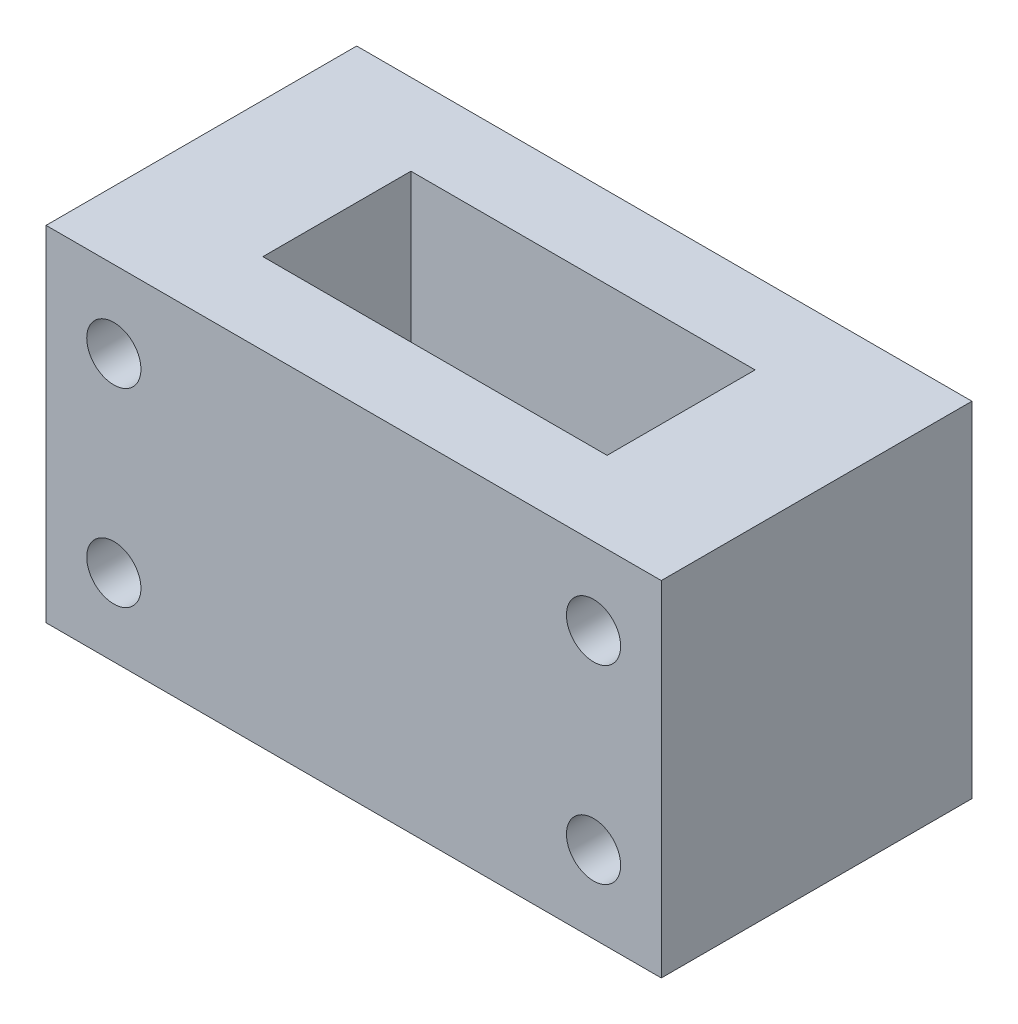
ISO-10303-21;
HEADER;
FILE_DESCRIPTION(('STEP AP214'),'2;1');
FILE_NAME('part.step','',(''),(''),'','','');
FILE_SCHEMA(('AUTOMOTIVE_DESIGN { 1 0 10303 214 1 1 1 1 }'));
ENDSEC;
DATA;
#1=APPLICATION_CONTEXT('core data for automotive mechanical design processes');
#2=APPLICATION_PROTOCOL_DEFINITION('international standard','automotive_design',2000,#1);
#3=PRODUCT_CONTEXT('',#1,'mechanical');
#4=PRODUCT('Part','Part','',(#3));
#5=PRODUCT_RELATED_PRODUCT_CATEGORY('part','',(#4));
#6=PRODUCT_DEFINITION_FORMATION('','',#4);
#7=PRODUCT_DEFINITION_CONTEXT('part definition',#1,'design');
#8=PRODUCT_DEFINITION('design','',#6,#7);
#9=PRODUCT_DEFINITION_SHAPE('','',#8);
#10=(LENGTH_UNIT() NAMED_UNIT(*) SI_UNIT(.MILLI.,.METRE.));
#11=(NAMED_UNIT(*) PLANE_ANGLE_UNIT() SI_UNIT($,.RADIAN.));
#12=(NAMED_UNIT(*) SI_UNIT($,.STERADIAN.) SOLID_ANGLE_UNIT());
#13=UNCERTAINTY_MEASURE_WITH_UNIT(LENGTH_MEASURE(1.E-05),#10,'distance_accuracy_value','');
#14=(GEOMETRIC_REPRESENTATION_CONTEXT(3) GLOBAL_UNCERTAINTY_ASSIGNED_CONTEXT((#13)) GLOBAL_UNIT_ASSIGNED_CONTEXT((#10,
#11,#12)) REPRESENTATION_CONTEXT('',''));
#15=CARTESIAN_POINT('',(0.,0.,0.));
#16=DIRECTION('',(0.,0.,1.));
#17=DIRECTION('',(1.,0.,0.));
#18=AXIS2_PLACEMENT_3D('',#15,#16,#17);
#19=CARTESIAN_POINT('',(0.,25.4,0.));
#20=DIRECTION('',(0.,1.,0.));
#21=DIRECTION('',(0.,0.,1.));
#22=AXIS2_PLACEMENT_3D('',#19,#20,#21);
#23=PLANE('',#22);
#24=DIRECTION('',(0.,0.,-1.));
#25=VECTOR('',#24,1.);
#26=CARTESIAN_POINT('',(22.7,25.4,-11.461));
#27=LINE('',#26,#25);
#28=CARTESIAN_POINT('',(22.7,25.4,11.461));
#29=VERTEX_POINT('',#28);
#30=CARTESIAN_POINT('',(22.7,25.4,-11.461));
#31=VERTEX_POINT('',#30);
#32=EDGE_CURVE('E140',#29,#31,#27,.T.);
#33=ORIENTED_EDGE('',*,*,#32,.T.);
#34=DIRECTION('',(-1.,0.,0.));
#35=VECTOR('',#34,1.);
#36=CARTESIAN_POINT('',(-22.7,25.4,-11.461));
#37=LINE('',#36,#35);
#38=CARTESIAN_POINT('',(-22.7,25.4,-11.461));
#39=VERTEX_POINT('',#38);
#40=EDGE_CURVE('E143',#31,#39,#37,.T.);
#41=ORIENTED_EDGE('',*,*,#40,.T.);
#42=DIRECTION('',(0.,0.,1.));
#43=VECTOR('',#42,1.);
#44=CARTESIAN_POINT('',(-22.7,25.4,-11.461));
#45=LINE('',#44,#43);
#46=CARTESIAN_POINT('',(-22.7,25.4,11.461));
#47=VERTEX_POINT('',#46);
#48=EDGE_CURVE('E146',#39,#47,#45,.T.);
#49=ORIENTED_EDGE('',*,*,#48,.T.);
#50=DIRECTION('',(1.,0.,0.));
#51=VECTOR('',#50,1.);
#52=CARTESIAN_POINT('',(-22.7,25.4,11.461));
#53=LINE('',#52,#51);
#54=EDGE_CURVE('E148',#47,#29,#53,.T.);
#55=ORIENTED_EDGE('',*,*,#54,.T.);
#56=EDGE_LOOP('',(#33,#41,#49,#55));
#57=FACE_BOUND('',#56,.T.);
#58=DIRECTION('',(-1.,0.,0.));
#59=VECTOR('',#58,1.);
#60=CARTESIAN_POINT('',(-12.7,25.4,-5.461));
#61=LINE('',#60,#59);
#62=CARTESIAN_POINT('',(12.7,25.4,-5.461));
#63=VERTEX_POINT('',#62);
#64=CARTESIAN_POINT('',(-12.7,25.4,-5.461));
#65=VERTEX_POINT('',#64);
#66=EDGE_CURVE('E110',#63,#65,#61,.T.);
#67=ORIENTED_EDGE('',*,*,#66,.F.);
#68=DIRECTION('',(0.,0.,-1.));
#69=VECTOR('',#68,1.);
#70=CARTESIAN_POINT('',(12.7,25.4,5.461));
#71=LINE('',#70,#69);
#72=CARTESIAN_POINT('',(12.7,25.4,5.461));
#73=VERTEX_POINT('',#72);
#74=EDGE_CURVE('E102',#73,#63,#71,.T.);
#75=ORIENTED_EDGE('',*,*,#74,.F.);
#76=DIRECTION('',(1.,0.,0.));
#77=VECTOR('',#76,1.);
#78=CARTESIAN_POINT('',(-12.7,25.4,5.461));
#79=LINE('',#78,#77);
#80=CARTESIAN_POINT('',(-12.7,25.4,5.461));
#81=VERTEX_POINT('',#80);
#82=EDGE_CURVE('E124',#81,#73,#79,.T.);
#83=ORIENTED_EDGE('',*,*,#82,.F.);
#84=DIRECTION('',(0.,0.,1.));
#85=VECTOR('',#84,1.);
#86=CARTESIAN_POINT('',(-12.7,25.4,5.461));
#87=LINE('',#86,#85);
#88=EDGE_CURVE('E122',#65,#81,#87,.T.);
#89=ORIENTED_EDGE('',*,*,#88,.F.);
#90=EDGE_LOOP('',(#67,#75,#83,#89));
#91=FACE_BOUND('',#90,.T.);
#92=ADVANCED_FACE('F37',(#57,#91),#23,.T.);
#93=CARTESIAN_POINT('',(0.,0.,0.));
#94=DIRECTION('',(0.,1.,0.));
#95=DIRECTION('',(0.,0.,1.));
#96=AXIS2_PLACEMENT_3D('',#93,#94,#95);
#97=PLANE('',#96);
#98=DIRECTION('',(0.,0.,-1.));
#99=VECTOR('',#98,1.);
#100=CARTESIAN_POINT('',(22.7,0.,-11.461));
#101=LINE('',#100,#99);
#102=CARTESIAN_POINT('',(22.7,0.,11.461));
#103=VERTEX_POINT('',#102);
#104=CARTESIAN_POINT('',(22.7,0.,-11.461));
#105=VERTEX_POINT('',#104);
#106=EDGE_CURVE('E118',#103,#105,#101,.T.);
#107=ORIENTED_EDGE('',*,*,#106,.F.);
#108=DIRECTION('',(1.,0.,0.));
#109=VECTOR('',#108,1.);
#110=CARTESIAN_POINT('',(-22.7,0.,11.461));
#111=LINE('',#110,#109);
#112=CARTESIAN_POINT('',(-22.7,0.,11.461));
#113=VERTEX_POINT('',#112);
#114=EDGE_CURVE('E144',#113,#103,#111,.T.);
#115=ORIENTED_EDGE('',*,*,#114,.F.);
#116=DIRECTION('',(0.,0.,1.));
#117=VECTOR('',#116,1.);
#118=CARTESIAN_POINT('',(-22.7,0.,-11.461));
#119=LINE('',#118,#117);
#120=CARTESIAN_POINT('',(-22.7,0.,-11.461));
#121=VERTEX_POINT('',#120);
#122=EDGE_CURVE('E155',#121,#113,#119,.T.);
#123=ORIENTED_EDGE('',*,*,#122,.F.);
#124=DIRECTION('',(-1.,0.,0.));
#125=VECTOR('',#124,1.);
#126=CARTESIAN_POINT('',(-22.7,0.,-11.461));
#127=LINE('',#126,#125);
#128=EDGE_CURVE('E153',#105,#121,#127,.T.);
#129=ORIENTED_EDGE('',*,*,#128,.F.);
#130=EDGE_LOOP('',(#107,#115,#123,#129));
#131=FACE_BOUND('',#130,.T.);
#132=DIRECTION('',(0.,0.,-1.));
#133=VECTOR('',#132,1.);
#134=CARTESIAN_POINT('',(12.7,0.,5.461));
#135=LINE('',#134,#133);
#136=CARTESIAN_POINT('',(12.7,0.,5.461));
#137=VERTEX_POINT('',#136);
#138=CARTESIAN_POINT('',(12.7,0.,-5.461));
#139=VERTEX_POINT('',#138);
#140=EDGE_CURVE('E60',#137,#139,#135,.T.);
#141=ORIENTED_EDGE('',*,*,#140,.T.);
#142=DIRECTION('',(-1.,0.,0.));
#143=VECTOR('',#142,1.);
#144=CARTESIAN_POINT('',(-12.7,0.,-5.461));
#145=LINE('',#144,#143);
#146=CARTESIAN_POINT('',(-12.7,0.,-5.461));
#147=VERTEX_POINT('',#146);
#148=EDGE_CURVE('E117',#139,#147,#145,.T.);
#149=ORIENTED_EDGE('',*,*,#148,.T.);
#150=DIRECTION('',(0.,0.,1.));
#151=VECTOR('',#150,1.);
#152=CARTESIAN_POINT('',(-12.7,0.,5.461));
#153=LINE('',#152,#151);
#154=CARTESIAN_POINT('',(-12.7,0.,5.461));
#155=VERTEX_POINT('',#154);
#156=EDGE_CURVE('E132',#147,#155,#153,.T.);
#157=ORIENTED_EDGE('',*,*,#156,.T.);
#158=DIRECTION('',(1.,0.,0.));
#159=VECTOR('',#158,1.);
#160=CARTESIAN_POINT('',(-12.7,0.,5.461));
#161=LINE('',#160,#159);
#162=EDGE_CURVE('E111',#155,#137,#161,.T.);
#163=ORIENTED_EDGE('',*,*,#162,.T.);
#164=EDGE_LOOP('',(#141,#149,#157,#163));
#165=FACE_BOUND('',#164,.T.);
#166=ADVANCED_FACE('F173',(#131,#165),#97,.F.);
#167=CARTESIAN_POINT('',(22.7,25.4,-11.461));
#168=DIRECTION('',(-1.,0.,0.));
#169=DIRECTION('',(0.,0.,1.));
#170=AXIS2_PLACEMENT_3D('',#167,#168,#169);
#171=PLANE('',#170);
#172=ORIENTED_EDGE('',*,*,#106,.T.);
#173=DIRECTION('',(0.,-1.,0.));
#174=VECTOR('',#173,1.);
#175=CARTESIAN_POINT('',(22.7,25.4,-11.461));
#176=LINE('',#175,#174);
#177=EDGE_CURVE('E11',#31,#105,#176,.T.);
#178=ORIENTED_EDGE('',*,*,#177,.F.);
#179=ORIENTED_EDGE('',*,*,#32,.F.);
#180=DIRECTION('',(0.,-1.,0.));
#181=VECTOR('',#180,1.);
#182=CARTESIAN_POINT('',(22.7,25.4,11.461));
#183=LINE('',#182,#181);
#184=EDGE_CURVE('E150',#29,#103,#183,.T.);
#185=ORIENTED_EDGE('',*,*,#184,.T.);
#186=EDGE_LOOP('',(#172,#178,#179,#185));
#187=FACE_BOUND('',#186,.T.);
#188=ADVANCED_FACE('F39',(#187),#171,.F.);
#189=CARTESIAN_POINT('',(-22.7,25.4,-11.461));
#190=DIRECTION('',(0.,0.,1.));
#191=DIRECTION('',(1.,0.,0.));
#192=AXIS2_PLACEMENT_3D('',#189,#190,#191);
#193=PLANE('',#192);
#194=CARTESIAN_POINT('',(-17.7,5.70000000000002,-11.461));
#195=DIRECTION('',(0.,0.,-1.));
#196=DIRECTION('',(1.,0.,0.));
#197=AXIS2_PLACEMENT_3D('',#194,#195,#196);
#198=CIRCLE('',#197,2.);
#199=CARTESIAN_POINT('',(-15.7,5.70000000000002,-11.461));
#200=VERTEX_POINT('',#199);
#201=EDGE_CURVE('E228',#200,#200,#198,.T.);
#202=ORIENTED_EDGE('',*,*,#201,.F.);
#203=EDGE_LOOP('',(#202));
#204=FACE_BOUND('',#203,.T.);
#205=CARTESIAN_POINT('',(-17.7,19.7,-11.461));
#206=DIRECTION('',(0.,0.,-1.));
#207=DIRECTION('',(-1.,0.,0.));
#208=AXIS2_PLACEMENT_3D('',#205,#206,#207);
#209=CIRCLE('',#208,2.);
#210=CARTESIAN_POINT('',(-19.7,19.7,-11.461));
#211=VERTEX_POINT('',#210);
#212=EDGE_CURVE('E232',#211,#211,#209,.T.);
#213=ORIENTED_EDGE('',*,*,#212,.F.);
#214=EDGE_LOOP('',(#213));
#215=FACE_BOUND('',#214,.T.);
#216=CARTESIAN_POINT('',(17.7,19.7,-11.461));
#217=DIRECTION('',(0.,0.,-1.));
#218=DIRECTION('',(1.,0.,0.));
#219=AXIS2_PLACEMENT_3D('',#216,#217,#218);
#220=CIRCLE('',#219,2.00000000000001);
#221=CARTESIAN_POINT('',(19.7,19.7,-11.461));
#222=VERTEX_POINT('',#221);
#223=EDGE_CURVE('E225',#222,#222,#220,.T.);
#224=ORIENTED_EDGE('',*,*,#223,.F.);
#225=EDGE_LOOP('',(#224));
#226=FACE_BOUND('',#225,.T.);
#227=CARTESIAN_POINT('',(17.7,5.7,-11.461));
#228=DIRECTION('',(0.,0.,-1.));
#229=DIRECTION('',(-1.,0.,0.));
#230=AXIS2_PLACEMENT_3D('',#227,#228,#229);
#231=CIRCLE('',#230,2.);
#232=CARTESIAN_POINT('',(15.7,5.7,-11.461));
#233=VERTEX_POINT('',#232);
#234=EDGE_CURVE('E222',#233,#233,#231,.T.);
#235=ORIENTED_EDGE('',*,*,#234,.F.);
#236=EDGE_LOOP('',(#235));
#237=FACE_BOUND('',#236,.T.);
#238=ORIENTED_EDGE('',*,*,#128,.T.);
#239=DIRECTION('',(0.,-1.,0.));
#240=VECTOR('',#239,1.);
#241=CARTESIAN_POINT('',(-22.7,25.4,-11.461));
#242=LINE('',#241,#240);
#243=EDGE_CURVE('E45',#39,#121,#242,.T.);
#244=ORIENTED_EDGE('',*,*,#243,.F.);
#245=ORIENTED_EDGE('',*,*,#40,.F.);
#246=ORIENTED_EDGE('',*,*,#177,.T.);
#247=EDGE_LOOP('',(#238,#244,#245,#246));
#248=FACE_BOUND('',#247,.T.);
#249=ADVANCED_FACE('F183',(#204,#215,#226,#237,#248),#193,.F.);
#250=CARTESIAN_POINT('',(-22.7,25.4,-11.461));
#251=DIRECTION('',(1.,0.,0.));
#252=DIRECTION('',(0.,0.,-1.));
#253=AXIS2_PLACEMENT_3D('',#250,#251,#252);
#254=PLANE('',#253);
#255=ORIENTED_EDGE('',*,*,#122,.T.);
#256=DIRECTION('',(0.,-1.,0.));
#257=VECTOR('',#256,1.);
#258=CARTESIAN_POINT('',(-22.7,25.4,11.461));
#259=LINE('',#258,#257);
#260=EDGE_CURVE('E160',#47,#113,#259,.T.);
#261=ORIENTED_EDGE('',*,*,#260,.F.);
#262=ORIENTED_EDGE('',*,*,#48,.F.);
#263=ORIENTED_EDGE('',*,*,#243,.T.);
#264=EDGE_LOOP('',(#255,#261,#262,#263));
#265=FACE_BOUND('',#264,.T.);
#266=ADVANCED_FACE('F167',(#265),#254,.F.);
#267=CARTESIAN_POINT('',(-22.7,25.4,11.461));
#268=DIRECTION('',(0.,0.,-1.));
#269=DIRECTION('',(-1.,0.,0.));
#270=AXIS2_PLACEMENT_3D('',#267,#268,#269);
#271=PLANE('',#270);
#272=CARTESIAN_POINT('',(-17.7,5.70000000000002,11.461));
#273=DIRECTION('',(0.,0.,-1.));
#274=DIRECTION('',(1.,0.,0.));
#275=AXIS2_PLACEMENT_3D('',#272,#273,#274);
#276=CIRCLE('',#275,2.);
#277=CARTESIAN_POINT('',(-15.7,5.70000000000002,11.461));
#278=VERTEX_POINT('',#277);
#279=EDGE_CURVE('E210',#278,#278,#276,.T.);
#280=ORIENTED_EDGE('',*,*,#279,.T.);
#281=EDGE_LOOP('',(#280));
#282=FACE_BOUND('',#281,.T.);
#283=CARTESIAN_POINT('',(-17.7,19.7,11.461));
#284=DIRECTION('',(0.,0.,-1.));
#285=DIRECTION('',(-1.,0.,0.));
#286=AXIS2_PLACEMENT_3D('',#283,#284,#285);
#287=CIRCLE('',#286,2.);
#288=CARTESIAN_POINT('',(-19.7,19.7,11.461));
#289=VERTEX_POINT('',#288);
#290=EDGE_CURVE('E214',#289,#289,#287,.T.);
#291=ORIENTED_EDGE('',*,*,#290,.T.);
#292=EDGE_LOOP('',(#291));
#293=FACE_BOUND('',#292,.T.);
#294=CARTESIAN_POINT('',(17.7,19.7,11.461));
#295=DIRECTION('',(0.,0.,-1.));
#296=DIRECTION('',(1.,0.,0.));
#297=AXIS2_PLACEMENT_3D('',#294,#295,#296);
#298=CIRCLE('',#297,2.00000000000001);
#299=CARTESIAN_POINT('',(19.7,19.7,11.461));
#300=VERTEX_POINT('',#299);
#301=EDGE_CURVE('E218',#300,#300,#298,.T.);
#302=ORIENTED_EDGE('',*,*,#301,.T.);
#303=EDGE_LOOP('',(#302));
#304=FACE_BOUND('',#303,.T.);
#305=CARTESIAN_POINT('',(17.7,5.7,11.461));
#306=DIRECTION('',(0.,0.,-1.));
#307=DIRECTION('',(-1.,0.,0.));
#308=AXIS2_PLACEMENT_3D('',#305,#306,#307);
#309=CIRCLE('',#308,2.);
#310=CARTESIAN_POINT('',(15.7,5.7,11.461));
#311=VERTEX_POINT('',#310);
#312=EDGE_CURVE('E130',#311,#311,#309,.T.);
#313=ORIENTED_EDGE('',*,*,#312,.T.);
#314=EDGE_LOOP('',(#313));
#315=FACE_BOUND('',#314,.T.);
#316=ORIENTED_EDGE('',*,*,#114,.T.);
#317=ORIENTED_EDGE('',*,*,#184,.F.);
#318=ORIENTED_EDGE('',*,*,#54,.F.);
#319=ORIENTED_EDGE('',*,*,#260,.T.);
#320=EDGE_LOOP('',(#316,#317,#318,#319));
#321=FACE_BOUND('',#320,.T.);
#322=ADVANCED_FACE('F177',(#282,#293,#304,#315,#321),#271,.F.);
#323=CARTESIAN_POINT('',(12.7,25.4,5.461));
#324=DIRECTION('',(-1.,0.,0.));
#325=DIRECTION('',(0.,0.,1.));
#326=AXIS2_PLACEMENT_3D('',#323,#324,#325);
#327=PLANE('',#326);
#328=ORIENTED_EDGE('',*,*,#140,.F.);
#329=DIRECTION('',(0.,-1.,0.));
#330=VECTOR('',#329,1.);
#331=CARTESIAN_POINT('',(12.7,25.4,5.461));
#332=LINE('',#331,#330);
#333=EDGE_CURVE('E106',#73,#137,#332,.T.);
#334=ORIENTED_EDGE('',*,*,#333,.F.);
#335=ORIENTED_EDGE('',*,*,#74,.T.);
#336=DIRECTION('',(0.,-1.,0.));
#337=VECTOR('',#336,1.);
#338=CARTESIAN_POINT('',(12.7,25.4,-5.461));
#339=LINE('',#338,#337);
#340=EDGE_CURVE('E105',#63,#139,#339,.T.);
#341=ORIENTED_EDGE('',*,*,#340,.T.);
#342=EDGE_LOOP('',(#328,#334,#335,#341));
#343=FACE_BOUND('',#342,.T.);
#344=ADVANCED_FACE('F104',(#343),#327,.T.);
#345=CARTESIAN_POINT('',(-12.7,25.4,-5.461));
#346=DIRECTION('',(0.,0.,1.));
#347=DIRECTION('',(1.,0.,0.));
#348=AXIS2_PLACEMENT_3D('',#345,#346,#347);
#349=PLANE('',#348);
#350=ORIENTED_EDGE('',*,*,#148,.F.);
#351=ORIENTED_EDGE('',*,*,#340,.F.);
#352=ORIENTED_EDGE('',*,*,#66,.T.);
#353=DIRECTION('',(0.,-1.,0.));
#354=VECTOR('',#353,1.);
#355=CARTESIAN_POINT('',(-12.7,25.4,-5.461));
#356=LINE('',#355,#354);
#357=EDGE_CURVE('E119',#65,#147,#356,.T.);
#358=ORIENTED_EDGE('',*,*,#357,.T.);
#359=EDGE_LOOP('',(#350,#351,#352,#358));
#360=FACE_BOUND('',#359,.T.);
#361=ADVANCED_FACE('F114',(#360),#349,.T.);
#362=CARTESIAN_POINT('',(-12.7,25.4,5.461));
#363=DIRECTION('',(1.,0.,0.));
#364=DIRECTION('',(0.,0.,-1.));
#365=AXIS2_PLACEMENT_3D('',#362,#363,#364);
#366=PLANE('',#365);
#367=ORIENTED_EDGE('',*,*,#156,.F.);
#368=ORIENTED_EDGE('',*,*,#357,.F.);
#369=ORIENTED_EDGE('',*,*,#88,.T.);
#370=DIRECTION('',(0.,-1.,0.));
#371=VECTOR('',#370,1.);
#372=CARTESIAN_POINT('',(-12.7,25.4,5.461));
#373=LINE('',#372,#371);
#374=EDGE_CURVE('E52',#81,#155,#373,.T.);
#375=ORIENTED_EDGE('',*,*,#374,.T.);
#376=EDGE_LOOP('',(#367,#368,#369,#375));
#377=FACE_BOUND('',#376,.T.);
#378=ADVANCED_FACE('F255',(#377),#366,.T.);
#379=CARTESIAN_POINT('',(-12.7,25.4,5.461));
#380=DIRECTION('',(0.,0.,-1.));
#381=DIRECTION('',(-1.,0.,0.));
#382=AXIS2_PLACEMENT_3D('',#379,#380,#381);
#383=PLANE('',#382);
#384=ORIENTED_EDGE('',*,*,#162,.F.);
#385=ORIENTED_EDGE('',*,*,#374,.F.);
#386=ORIENTED_EDGE('',*,*,#82,.T.);
#387=ORIENTED_EDGE('',*,*,#333,.T.);
#388=EDGE_LOOP('',(#384,#385,#386,#387));
#389=FACE_BOUND('',#388,.T.);
#390=ADVANCED_FACE('F246',(#389),#383,.T.);
#391=CARTESIAN_POINT('',(17.7,5.7,11.461));
#392=DIRECTION('',(0.,0.,-1.));
#393=DIRECTION('',(-1.,0.,0.));
#394=AXIS2_PLACEMENT_3D('',#391,#392,#393);
#395=CYLINDRICAL_SURFACE('',#394,2.);
#396=ORIENTED_EDGE('',*,*,#312,.F.);
#397=EDGE_LOOP('',(#396));
#398=FACE_BOUND('',#397,.T.);
#399=ORIENTED_EDGE('',*,*,#234,.T.);
#400=EDGE_LOOP('',(#399));
#401=FACE_BOUND('',#400,.T.);
#402=ADVANCED_FACE('F244',(#398,#401),#395,.F.);
#403=CARTESIAN_POINT('',(17.7,19.7,11.461));
#404=DIRECTION('',(0.,0.,-1.));
#405=DIRECTION('',(-1.,0.,0.));
#406=AXIS2_PLACEMENT_3D('',#403,#404,#405);
#407=CYLINDRICAL_SURFACE('',#406,2.00000000000001);
#408=ORIENTED_EDGE('',*,*,#301,.F.);
#409=EDGE_LOOP('',(#408));
#410=FACE_BOUND('',#409,.T.);
#411=ORIENTED_EDGE('',*,*,#223,.T.);
#412=EDGE_LOOP('',(#411));
#413=FACE_BOUND('',#412,.T.);
#414=ADVANCED_FACE('F239',(#410,#413),#407,.F.);
#415=CARTESIAN_POINT('',(-17.7,19.7,11.461));
#416=DIRECTION('',(0.,0.,-1.));
#417=DIRECTION('',(-1.,0.,0.));
#418=AXIS2_PLACEMENT_3D('',#415,#416,#417);
#419=CYLINDRICAL_SURFACE('',#418,2.);
#420=ORIENTED_EDGE('',*,*,#290,.F.);
#421=EDGE_LOOP('',(#420));
#422=FACE_BOUND('',#421,.T.);
#423=ORIENTED_EDGE('',*,*,#212,.T.);
#424=EDGE_LOOP('',(#423));
#425=FACE_BOUND('',#424,.T.);
#426=ADVANCED_FACE('F252',(#422,#425),#419,.F.);
#427=CARTESIAN_POINT('',(-17.7,5.70000000000002,11.461));
#428=DIRECTION('',(0.,0.,-1.));
#429=DIRECTION('',(-1.,0.,0.));
#430=AXIS2_PLACEMENT_3D('',#427,#428,#429);
#431=CYLINDRICAL_SURFACE('',#430,2.);
#432=ORIENTED_EDGE('',*,*,#279,.F.);
#433=EDGE_LOOP('',(#432));
#434=FACE_BOUND('',#433,.T.);
#435=ORIENTED_EDGE('',*,*,#201,.T.);
#436=EDGE_LOOP('',(#435));
#437=FACE_BOUND('',#436,.T.);
#438=ADVANCED_FACE('F258',(#434,#437),#431,.F.);
#439=CLOSED_SHELL('',(#92,#166,#188,#249,#266,#322,#344,#361,#378,#390,#402,#414,#426,#438));
#440=MANIFOLD_SOLID_BREP('B2',#439);
#441=ADVANCED_BREP_SHAPE_REPRESENTATION('',(#18,#440),#14);
#442=SHAPE_DEFINITION_REPRESENTATION(#9,#441);
ENDSEC;
END-ISO-10303-21;
